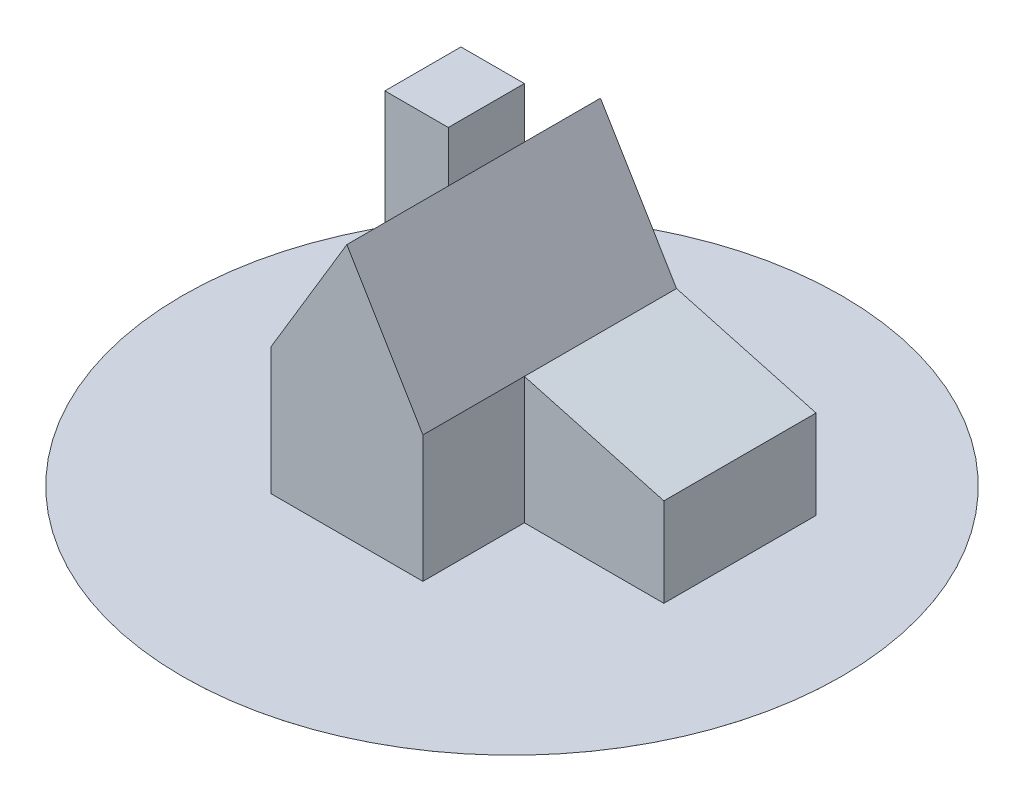
ISO-10303-21;
HEADER;
FILE_DESCRIPTION(('STEP AP214'),'2;1');
FILE_NAME('part.step','',(''),(''),'','','');
FILE_SCHEMA(('AUTOMOTIVE_DESIGN { 1 0 10303 214 1 1 1 1 }'));
ENDSEC;
DATA;
#1=APPLICATION_CONTEXT('core data for automotive mechanical design processes');
#2=APPLICATION_PROTOCOL_DEFINITION('international standard','automotive_design',2000,#1);
#3=PRODUCT_CONTEXT('',#1,'mechanical');
#4=PRODUCT('Part','Part','',(#3));
#5=PRODUCT_RELATED_PRODUCT_CATEGORY('part','',(#4));
#6=PRODUCT_DEFINITION_FORMATION('','',#4);
#7=PRODUCT_DEFINITION_CONTEXT('part definition',#1,'design');
#8=PRODUCT_DEFINITION('design','',#6,#7);
#9=PRODUCT_DEFINITION_SHAPE('','',#8);
#10=(LENGTH_UNIT() NAMED_UNIT(*) SI_UNIT(.MILLI.,.METRE.));
#11=(NAMED_UNIT(*) PLANE_ANGLE_UNIT() SI_UNIT($,.RADIAN.));
#12=(NAMED_UNIT(*) SI_UNIT($,.STERADIAN.) SOLID_ANGLE_UNIT());
#13=UNCERTAINTY_MEASURE_WITH_UNIT(LENGTH_MEASURE(1.E-05),#10,'distance_accuracy_value','');
#14=(GEOMETRIC_REPRESENTATION_CONTEXT(3) GLOBAL_UNCERTAINTY_ASSIGNED_CONTEXT((#13)) GLOBAL_UNIT_ASSIGNED_CONTEXT((#10,
#11,#12)) REPRESENTATION_CONTEXT('',''));
#15=CARTESIAN_POINT('',(0.,0.,0.));
#16=DIRECTION('',(0.,0.,1.));
#17=DIRECTION('',(1.,0.,0.));
#18=AXIS2_PLACEMENT_3D('',#15,#16,#17);
#19=CARTESIAN_POINT('',(110.,70.,200.));
#20=DIRECTION('',(-1.,0.,0.));
#21=DIRECTION('',(0.,-1.,0.));
#22=AXIS2_PLACEMENT_3D('',#19,#20,#21);
#23=PLANE('',#22);
#24=DIRECTION('',(0.,-1.,0.));
#25=VECTOR('',#24,1.);
#26=CARTESIAN_POINT('',(110.,200.,120.));
#27=LINE('',#26,#25);
#28=CARTESIAN_POINT('',(110.,70.,120.));
#29=VERTEX_POINT('',#28);
#30=CARTESIAN_POINT('',(110.,0.00999999999999612,120.));
#31=VERTEX_POINT('',#30);
#32=EDGE_CURVE('E157',#29,#31,#27,.T.);
#33=ORIENTED_EDGE('',*,*,#32,.T.);
#34=DIRECTION('',(0.,0.,-1.));
#35=VECTOR('',#34,1.);
#36=CARTESIAN_POINT('',(110.,0.00999999999999612,200.));
#37=LINE('',#36,#35);
#38=CARTESIAN_POINT('',(110.,0.01,0.));
#39=VERTEX_POINT('',#38);
#40=EDGE_CURVE('E218',#31,#39,#37,.T.);
#41=ORIENTED_EDGE('',*,*,#40,.T.);
#42=DIRECTION('',(0.,1.,0.));
#43=VECTOR('',#42,1.);
#44=CARTESIAN_POINT('',(110.,70.,0.));
#45=LINE('',#44,#43);
#46=CARTESIAN_POINT('',(110.,70.,0.));
#47=VERTEX_POINT('',#46);
#48=EDGE_CURVE('E162',#39,#47,#45,.T.);
#49=ORIENTED_EDGE('',*,*,#48,.T.);
#50=DIRECTION('',(0.,0.,-1.));
#51=VECTOR('',#50,1.);
#52=CARTESIAN_POINT('',(110.,70.,200.));
#53=LINE('',#52,#51);
#54=EDGE_CURVE('E203',#29,#47,#53,.T.);
#55=ORIENTED_EDGE('',*,*,#54,.F.);
#56=EDGE_LOOP('',(#33,#41,#49,#55));
#57=FACE_BOUND('',#56,.T.);
#58=ADVANCED_FACE('F30',(#57),#23,.F.);
#59=CARTESIAN_POINT('',(0.,100.,200.));
#60=DIRECTION('',(-0.263117405792109,-0.964763821237732,0.));
#61=DIRECTION('',(0.964763821237732,-0.263117405792109,0.));
#62=AXIS2_PLACEMENT_3D('',#59,#60,#61);
#63=PLANE('',#62);
#64=DIRECTION('',(-0.964763821237732,0.263117405792109,0.));
#65=VECTOR('',#64,1.);
#66=CARTESIAN_POINT('',(0.,100.,120.));
#67=LINE('',#66,#65);
#68=CARTESIAN_POINT('',(0.,100.,120.));
#69=VERTEX_POINT('',#68);
#70=EDGE_CURVE('E160',#29,#69,#67,.T.);
#71=ORIENTED_EDGE('',*,*,#70,.F.);
#72=ORIENTED_EDGE('',*,*,#54,.T.);
#73=DIRECTION('',(-0.964763821237732,0.263117405792109,0.));
#74=VECTOR('',#73,1.);
#75=CARTESIAN_POINT('',(0.,100.,0.));
#76=LINE('',#75,#74);
#77=CARTESIAN_POINT('',(0.,100.,0.));
#78=VERTEX_POINT('',#77);
#79=EDGE_CURVE('E171',#47,#78,#76,.T.);
#80=ORIENTED_EDGE('',*,*,#79,.T.);
#81=DIRECTION('',(0.,0.,-1.));
#82=VECTOR('',#81,1.);
#83=CARTESIAN_POINT('',(0.,100.,200.));
#84=LINE('',#83,#82);
#85=EDGE_CURVE('E208',#69,#78,#84,.T.);
#86=ORIENTED_EDGE('',*,*,#85,.F.);
#87=EDGE_LOOP('',(#71,#72,#80,#86));
#88=FACE_BOUND('',#87,.T.);
#89=ADVANCED_FACE('F214',(#88),#63,.F.);
#90=CARTESIAN_POINT('',(-120.,0.,200.));
#91=DIRECTION('',(0.,0.,1.));
#92=DIRECTION('',(1.,0.,0.));
#93=AXIS2_PLACEMENT_3D('',#90,#91,#92);
#94=PLANE('',#93);
#95=DIRECTION('',(-1.,0.,0.));
#96=VECTOR('',#95,1.);
#97=CARTESIAN_POINT('',(-120.,0.01,200.));
#98=LINE('',#97,#96);
#99=CARTESIAN_POINT('',(0.,0.01,200.));
#100=VERTEX_POINT('',#99);
#101=CARTESIAN_POINT('',(-120.,0.00999999999999612,200.));
#102=VERTEX_POINT('',#101);
#103=EDGE_CURVE('E221',#100,#102,#98,.T.);
#104=ORIENTED_EDGE('',*,*,#103,.F.);
#105=DIRECTION('',(0.,1.,0.));
#106=VECTOR('',#105,1.);
#107=CARTESIAN_POINT('',(0.,0.,200.));
#108=LINE('',#107,#106);
#109=CARTESIAN_POINT('',(0.,100.,200.));
#110=VERTEX_POINT('',#109);
#111=EDGE_CURVE('E74',#100,#110,#108,.T.);
#112=ORIENTED_EDGE('',*,*,#111,.T.);
#113=DIRECTION('',(-0.514495755427526,0.857492925712544,0.));
#114=VECTOR('',#113,1.);
#115=CARTESIAN_POINT('',(-60.,200.,200.));
#116=LINE('',#115,#114);
#117=CARTESIAN_POINT('',(-60.,200.,200.));
#118=VERTEX_POINT('',#117);
#119=EDGE_CURVE('E163',#110,#118,#116,.T.);
#120=ORIENTED_EDGE('',*,*,#119,.T.);
#121=DIRECTION('',(-0.514495755427526,-0.857492925712544,0.));
#122=VECTOR('',#121,1.);
#123=CARTESIAN_POINT('',(-60.,200.,200.));
#124=LINE('',#123,#122);
#125=CARTESIAN_POINT('',(-120.,100.,200.));
#126=VERTEX_POINT('',#125);
#127=EDGE_CURVE('E52',#118,#126,#124,.T.);
#128=ORIENTED_EDGE('',*,*,#127,.T.);
#129=DIRECTION('',(0.,-1.,0.));
#130=VECTOR('',#129,1.);
#131=CARTESIAN_POINT('',(-120.,100.,200.));
#132=LINE('',#131,#130);
#133=EDGE_CURVE('E167',#126,#102,#132,.T.);
#134=ORIENTED_EDGE('',*,*,#133,.T.);
#135=EDGE_LOOP('',(#104,#112,#120,#128,#134));
#136=FACE_BOUND('',#135,.T.);
#137=ADVANCED_FACE('F248',(#136),#94,.T.);
#138=CARTESIAN_POINT('',(-60.,200.,200.));
#139=DIRECTION('',(-0.857492925712544,-0.514495755427526,0.));
#140=DIRECTION('',(0.514495755427526,-0.857492925712544,0.));
#141=AXIS2_PLACEMENT_3D('',#138,#139,#140);
#142=PLANE('',#141);
#143=DIRECTION('',(-0.514495755427526,0.857492925712544,0.));
#144=VECTOR('',#143,1.);
#145=CARTESIAN_POINT('',(-60.,200.,0.));
#146=LINE('',#145,#144);
#147=CARTESIAN_POINT('',(-60.,200.,0.));
#148=VERTEX_POINT('',#147);
#149=EDGE_CURVE('E69',#78,#148,#146,.T.);
#150=ORIENTED_EDGE('',*,*,#149,.T.);
#151=DIRECTION('',(0.,0.,-1.));
#152=VECTOR('',#151,1.);
#153=CARTESIAN_POINT('',(-60.,200.,200.));
#154=LINE('',#153,#152);
#155=EDGE_CURVE('E179',#118,#148,#154,.T.);
#156=ORIENTED_EDGE('',*,*,#155,.F.);
#157=ORIENTED_EDGE('',*,*,#119,.F.);
#158=EDGE_CURVE('E205',#110,#69,#84,.T.);
#159=ORIENTED_EDGE('',*,*,#158,.T.);
#160=ORIENTED_EDGE('',*,*,#85,.T.);
#161=EDGE_LOOP('',(#150,#156,#157,#159,#160));
#162=FACE_BOUND('',#161,.T.);
#163=ADVANCED_FACE('F211',(#162),#142,.F.);
#164=CARTESIAN_POINT('',(-60.,200.,200.));
#165=DIRECTION('',(0.857492925712544,-0.514495755427526,0.));
#166=DIRECTION('',(0.514495755427526,0.857492925712544,0.));
#167=AXIS2_PLACEMENT_3D('',#164,#165,#166);
#168=PLANE('',#167);
#169=DIRECTION('',(-0.514495755427526,-0.857492925712544,0.));
#170=VECTOR('',#169,1.);
#171=CARTESIAN_POINT('',(-60.,200.,0.));
#172=LINE('',#171,#170);
#173=CARTESIAN_POINT('',(-120.,100.,0.));
#174=VERTEX_POINT('',#173);
#175=EDGE_CURVE('E165',#148,#174,#172,.T.);
#176=ORIENTED_EDGE('',*,*,#175,.T.);
#177=DIRECTION('',(0.,0.,-1.));
#178=VECTOR('',#177,1.);
#179=CARTESIAN_POINT('',(-120.,100.,200.));
#180=LINE('',#179,#178);
#181=CARTESIAN_POINT('',(-120.,100.,60.));
#182=VERTEX_POINT('',#181);
#183=EDGE_CURVE('E169',#182,#174,#180,.T.);
#184=ORIENTED_EDGE('',*,*,#183,.F.);
#185=EDGE_CURVE('E175',#126,#182,#180,.T.);
#186=ORIENTED_EDGE('',*,*,#185,.F.);
#187=ORIENTED_EDGE('',*,*,#127,.F.);
#188=ORIENTED_EDGE('',*,*,#155,.T.);
#189=EDGE_LOOP('',(#176,#184,#186,#187,#188));
#190=FACE_BOUND('',#189,.T.);
#191=ADVANCED_FACE('F190',(#190),#168,.F.);
#192=CARTESIAN_POINT('',(-120.,100.,200.));
#193=DIRECTION('',(1.,0.,0.));
#194=DIRECTION('',(0.,1.,0.));
#195=AXIS2_PLACEMENT_3D('',#192,#193,#194);
#196=PLANE('',#195);
#197=DIRECTION('',(0.,-1.,0.));
#198=VECTOR('',#197,1.);
#199=CARTESIAN_POINT('',(-120.,180.,60.));
#200=LINE('',#199,#198);
#201=CARTESIAN_POINT('',(-120.,0.0100000000000239,60.));
#202=VERTEX_POINT('',#201);
#203=EDGE_CURVE('E37',#182,#202,#200,.T.);
#204=ORIENTED_EDGE('',*,*,#203,.T.);
#205=DIRECTION('',(0.,0.,1.));
#206=VECTOR('',#205,1.);
#207=CARTESIAN_POINT('',(-120.,0.00999999999999612,200.));
#208=LINE('',#207,#206);
#209=EDGE_CURVE('E44',#202,#102,#208,.T.);
#210=ORIENTED_EDGE('',*,*,#209,.T.);
#211=ORIENTED_EDGE('',*,*,#133,.F.);
#212=ORIENTED_EDGE('',*,*,#185,.T.);
#213=EDGE_LOOP('',(#204,#210,#211,#212));
#214=FACE_BOUND('',#213,.T.);
#215=ADVANCED_FACE('F258',(#214),#196,.F.);
#216=CARTESIAN_POINT('',(-120.,0.,0.));
#217=DIRECTION('',(0.,0.,1.));
#218=DIRECTION('',(1.,0.,0.));
#219=AXIS2_PLACEMENT_3D('',#216,#217,#218);
#220=PLANE('',#219);
#221=ORIENTED_EDGE('',*,*,#48,.F.);
#222=DIRECTION('',(-1.,0.,0.));
#223=VECTOR('',#222,1.);
#224=CARTESIAN_POINT('',(-120.,0.01,0.));
#225=LINE('',#224,#223);
#226=CARTESIAN_POINT('',(-170.,0.01000000000001,0.));
#227=VERTEX_POINT('',#226);
#228=EDGE_CURVE('E135',#39,#227,#225,.T.);
#229=ORIENTED_EDGE('',*,*,#228,.T.);
#230=DIRECTION('',(0.,-1.,0.));
#231=VECTOR('',#230,1.);
#232=CARTESIAN_POINT('',(-170.,180.,0.));
#233=LINE('',#232,#231);
#234=CARTESIAN_POINT('',(-170.,180.,0.));
#235=VERTEX_POINT('',#234);
#236=EDGE_CURVE('E134',#235,#227,#233,.T.);
#237=ORIENTED_EDGE('',*,*,#236,.F.);
#238=DIRECTION('',(-1.,0.,0.));
#239=VECTOR('',#238,1.);
#240=CARTESIAN_POINT('',(-120.,180.,0.));
#241=LINE('',#240,#239);
#242=CARTESIAN_POINT('',(-120.,180.,0.));
#243=VERTEX_POINT('',#242);
#244=EDGE_CURVE('E196',#243,#235,#241,.T.);
#245=ORIENTED_EDGE('',*,*,#244,.F.);
#246=DIRECTION('',(0.,-1.,0.));
#247=VECTOR('',#246,1.);
#248=CARTESIAN_POINT('',(-120.,180.,0.));
#249=LINE('',#248,#247);
#250=EDGE_CURVE('E143',#243,#174,#249,.T.);
#251=ORIENTED_EDGE('',*,*,#250,.T.);
#252=ORIENTED_EDGE('',*,*,#175,.F.);
#253=ORIENTED_EDGE('',*,*,#149,.F.);
#254=ORIENTED_EDGE('',*,*,#79,.F.);
#255=EDGE_LOOP('',(#221,#229,#237,#245,#251,#252,#253,#254));
#256=FACE_BOUND('',#255,.T.);
#257=ADVANCED_FACE('F193',(#256),#220,.F.);
#258=CARTESIAN_POINT('',(110.,200.,120.));
#259=DIRECTION('',(0.,0.,1.));
#260=DIRECTION('',(1.,0.,0.));
#261=AXIS2_PLACEMENT_3D('',#258,#259,#260);
#262=PLANE('',#261);
#263=DIRECTION('',(-1.,0.,0.));
#264=VECTOR('',#263,1.);
#265=CARTESIAN_POINT('',(110.,0.01000000000001,120.));
#266=LINE('',#265,#264);
#267=CARTESIAN_POINT('',(0.,0.01000000000001,120.));
#268=VERTEX_POINT('',#267);
#269=EDGE_CURVE('E223',#31,#268,#266,.T.);
#270=ORIENTED_EDGE('',*,*,#269,.F.);
#271=ORIENTED_EDGE('',*,*,#32,.F.);
#272=ORIENTED_EDGE('',*,*,#70,.T.);
#273=DIRECTION('',(0.,-1.,0.));
#274=VECTOR('',#273,1.);
#275=CARTESIAN_POINT('',(0.,200.,120.));
#276=LINE('',#275,#274);
#277=EDGE_CURVE('E154',#69,#268,#276,.T.);
#278=ORIENTED_EDGE('',*,*,#277,.T.);
#279=EDGE_LOOP('',(#270,#271,#272,#278));
#280=FACE_BOUND('',#279,.T.);
#281=ADVANCED_FACE('F266',(#280),#262,.T.);
#282=CARTESIAN_POINT('',(0.,200.,200.));
#283=DIRECTION('',(1.,0.,0.));
#284=DIRECTION('',(0.,0.,-1.));
#285=AXIS2_PLACEMENT_3D('',#282,#283,#284);
#286=PLANE('',#285);
#287=DIRECTION('',(0.,0.,1.));
#288=VECTOR('',#287,1.);
#289=CARTESIAN_POINT('',(0.,0.01000000000001,200.));
#290=LINE('',#289,#288);
#291=EDGE_CURVE('E220',#268,#100,#290,.T.);
#292=ORIENTED_EDGE('',*,*,#291,.F.);
#293=ORIENTED_EDGE('',*,*,#277,.F.);
#294=ORIENTED_EDGE('',*,*,#158,.F.);
#295=ORIENTED_EDGE('',*,*,#111,.F.);
#296=EDGE_LOOP('',(#292,#293,#294,#295));
#297=FACE_BOUND('',#296,.T.);
#298=ADVANCED_FACE('F270',(#297),#286,.T.);
#299=CARTESIAN_POINT('',(-120.,180.,0.));
#300=DIRECTION('',(-1.,0.,0.));
#301=DIRECTION('',(0.,0.,1.));
#302=AXIS2_PLACEMENT_3D('',#299,#300,#301);
#303=PLANE('',#302);
#304=CARTESIAN_POINT('',(-120.,180.,60.));
#305=VERTEX_POINT('',#304);
#306=EDGE_CURVE('E141',#305,#182,#200,.T.);
#307=ORIENTED_EDGE('',*,*,#306,.T.);
#308=ORIENTED_EDGE('',*,*,#183,.T.);
#309=ORIENTED_EDGE('',*,*,#250,.F.);
#310=DIRECTION('',(0.,0.,-1.));
#311=VECTOR('',#310,1.);
#312=CARTESIAN_POINT('',(-120.,180.,0.));
#313=LINE('',#312,#311);
#314=EDGE_CURVE('E201',#305,#243,#313,.T.);
#315=ORIENTED_EDGE('',*,*,#314,.F.);
#316=EDGE_LOOP('',(#307,#308,#309,#315));
#317=FACE_BOUND('',#316,.T.);
#318=ADVANCED_FACE('F200',(#317),#303,.F.);
#319=CARTESIAN_POINT('',(-170.,180.,0.));
#320=DIRECTION('',(1.,0.,0.));
#321=DIRECTION('',(0.,0.,-1.));
#322=AXIS2_PLACEMENT_3D('',#319,#320,#321);
#323=PLANE('',#322);
#324=ORIENTED_EDGE('',*,*,#236,.T.);
#325=DIRECTION('',(0.,0.,1.));
#326=VECTOR('',#325,1.);
#327=CARTESIAN_POINT('',(-170.,0.01000000000001,0.));
#328=LINE('',#327,#326);
#329=CARTESIAN_POINT('',(-170.,0.01000000000001,60.));
#330=VERTEX_POINT('',#329);
#331=EDGE_CURVE('E121',#227,#330,#328,.T.);
#332=ORIENTED_EDGE('',*,*,#331,.T.);
#333=DIRECTION('',(0.,-1.,0.));
#334=VECTOR('',#333,1.);
#335=CARTESIAN_POINT('',(-170.,180.,60.));
#336=LINE('',#335,#334);
#337=CARTESIAN_POINT('',(-170.,180.,60.));
#338=VERTEX_POINT('',#337);
#339=EDGE_CURVE('E131',#338,#330,#336,.T.);
#340=ORIENTED_EDGE('',*,*,#339,.F.);
#341=DIRECTION('',(0.,0.,1.));
#342=VECTOR('',#341,1.);
#343=CARTESIAN_POINT('',(-170.,180.,0.));
#344=LINE('',#343,#342);
#345=EDGE_CURVE('E231',#235,#338,#344,.T.);
#346=ORIENTED_EDGE('',*,*,#345,.F.);
#347=EDGE_LOOP('',(#324,#332,#340,#346));
#348=FACE_BOUND('',#347,.T.);
#349=ADVANCED_FACE('F129',(#348),#323,.F.);
#350=CARTESIAN_POINT('',(-120.,180.,60.));
#351=DIRECTION('',(0.,0.,-1.));
#352=DIRECTION('',(-1.,0.,0.));
#353=AXIS2_PLACEMENT_3D('',#350,#351,#352);
#354=PLANE('',#353);
#355=ORIENTED_EDGE('',*,*,#339,.T.);
#356=DIRECTION('',(1.,0.,0.));
#357=VECTOR('',#356,1.);
#358=CARTESIAN_POINT('',(-120.,0.01000000000001,60.));
#359=LINE('',#358,#357);
#360=EDGE_CURVE('E11',#330,#202,#359,.T.);
#361=ORIENTED_EDGE('',*,*,#360,.T.);
#362=ORIENTED_EDGE('',*,*,#203,.F.);
#363=ORIENTED_EDGE('',*,*,#306,.F.);
#364=DIRECTION('',(1.,0.,0.));
#365=VECTOR('',#364,1.);
#366=CARTESIAN_POINT('',(-120.,180.,60.));
#367=LINE('',#366,#365);
#368=EDGE_CURVE('E140',#338,#305,#367,.T.);
#369=ORIENTED_EDGE('',*,*,#368,.F.);
#370=EDGE_LOOP('',(#355,#361,#362,#363,#369));
#371=FACE_BOUND('',#370,.T.);
#372=ADVANCED_FACE('F138',(#371),#354,.F.);
#373=CARTESIAN_POINT('',(-120.,180.,60.));
#374=DIRECTION('',(0.,-1.,0.));
#375=DIRECTION('',(0.,0.,-1.));
#376=AXIS2_PLACEMENT_3D('',#373,#374,#375);
#377=PLANE('',#376);
#378=ORIENTED_EDGE('',*,*,#314,.T.);
#379=ORIENTED_EDGE('',*,*,#244,.T.);
#380=ORIENTED_EDGE('',*,*,#345,.T.);
#381=ORIENTED_EDGE('',*,*,#368,.T.);
#382=EDGE_LOOP('',(#378,#379,#380,#381));
#383=FACE_BOUND('',#382,.T.);
#384=ADVANCED_FACE('F233',(#383),#377,.F.);
#385=CARTESIAN_POINT('',(-30.,0.01,99.7599659531261));
#386=DIRECTION('',(0.,-1.,0.));
#387=DIRECTION('',(0.,0.,-1.));
#388=AXIS2_PLACEMENT_3D('',#385,#386,#387);
#389=CYLINDRICAL_SURFACE('',#388,260.);
#390=CARTESIAN_POINT('',(-30.,0.01,99.7599659531261));
#391=DIRECTION('',(0.,1.,0.));
#392=DIRECTION('',(0.,0.,1.));
#393=AXIS2_PLACEMENT_3D('',#390,#391,#392);
#394=CIRCLE('',#393,260.);
#395=CARTESIAN_POINT('',(-30.,0.01,359.759965953126));
#396=VERTEX_POINT('',#395);
#397=EDGE_CURVE('E136',#396,#396,#394,.T.);
#398=ORIENTED_EDGE('',*,*,#397,.F.);
#399=EDGE_LOOP('',(#398));
#400=FACE_BOUND('',#399,.T.);
#401=CARTESIAN_POINT('',(-30.,0.,99.7599659531261));
#402=DIRECTION('',(0.,1.,0.));
#403=DIRECTION('',(0.,0.,1.));
#404=AXIS2_PLACEMENT_3D('',#401,#402,#403);
#405=CIRCLE('',#404,260.);
#406=CARTESIAN_POINT('',(-30.,0.,359.759965953126));
#407=VERTEX_POINT('',#406);
#408=EDGE_CURVE('E387',#407,#407,#405,.T.);
#409=ORIENTED_EDGE('',*,*,#408,.T.);
#410=EDGE_LOOP('',(#409));
#411=FACE_BOUND('',#410,.T.);
#412=ADVANCED_FACE('F235',(#400,#411),#389,.T.);
#413=CARTESIAN_POINT('',(-30.,0.01,99.7599659531261));
#414=DIRECTION('',(0.,1.,0.));
#415=DIRECTION('',(0.,0.,1.));
#416=AXIS2_PLACEMENT_3D('',#413,#414,#415);
#417=PLANE('',#416);
#418=ORIENTED_EDGE('',*,*,#40,.F.);
#419=ORIENTED_EDGE('',*,*,#269,.T.);
#420=ORIENTED_EDGE('',*,*,#291,.T.);
#421=ORIENTED_EDGE('',*,*,#103,.T.);
#422=ORIENTED_EDGE('',*,*,#209,.F.);
#423=ORIENTED_EDGE('',*,*,#360,.F.);
#424=ORIENTED_EDGE('',*,*,#331,.F.);
#425=ORIENTED_EDGE('',*,*,#228,.F.);
#426=EDGE_LOOP('',(#418,#419,#420,#421,#422,#423,#424,#425));
#427=FACE_BOUND('',#426,.T.);
#428=ORIENTED_EDGE('',*,*,#397,.T.);
#429=EDGE_LOOP('',(#428));
#430=FACE_BOUND('',#429,.T.);
#431=ADVANCED_FACE('F119',(#427,#430),#417,.T.);
#432=CARTESIAN_POINT('',(-120.,0.,200.));
#433=DIRECTION('',(0.,1.,0.));
#434=DIRECTION('',(0.,0.,1.));
#435=AXIS2_PLACEMENT_3D('',#432,#433,#434);
#436=PLANE('',#435);
#437=ORIENTED_EDGE('',*,*,#408,.F.);
#438=EDGE_LOOP('',(#437));
#439=FACE_BOUND('',#438,.T.);
#440=ADVANCED_FACE('F261',(#439),#436,.F.);
#441=CLOSED_SHELL('',(#58,#89,#137,#163,#191,#215,#257,#281,#298,#318,#349,#372,#384,#412,#431,#440));
#442=MANIFOLD_SOLID_BREP('B2',#441);
#443=ADVANCED_BREP_SHAPE_REPRESENTATION('',(#18,#442),#14);
#444=SHAPE_DEFINITION_REPRESENTATION(#9,#443);
ENDSEC;
END-ISO-10303-21;
